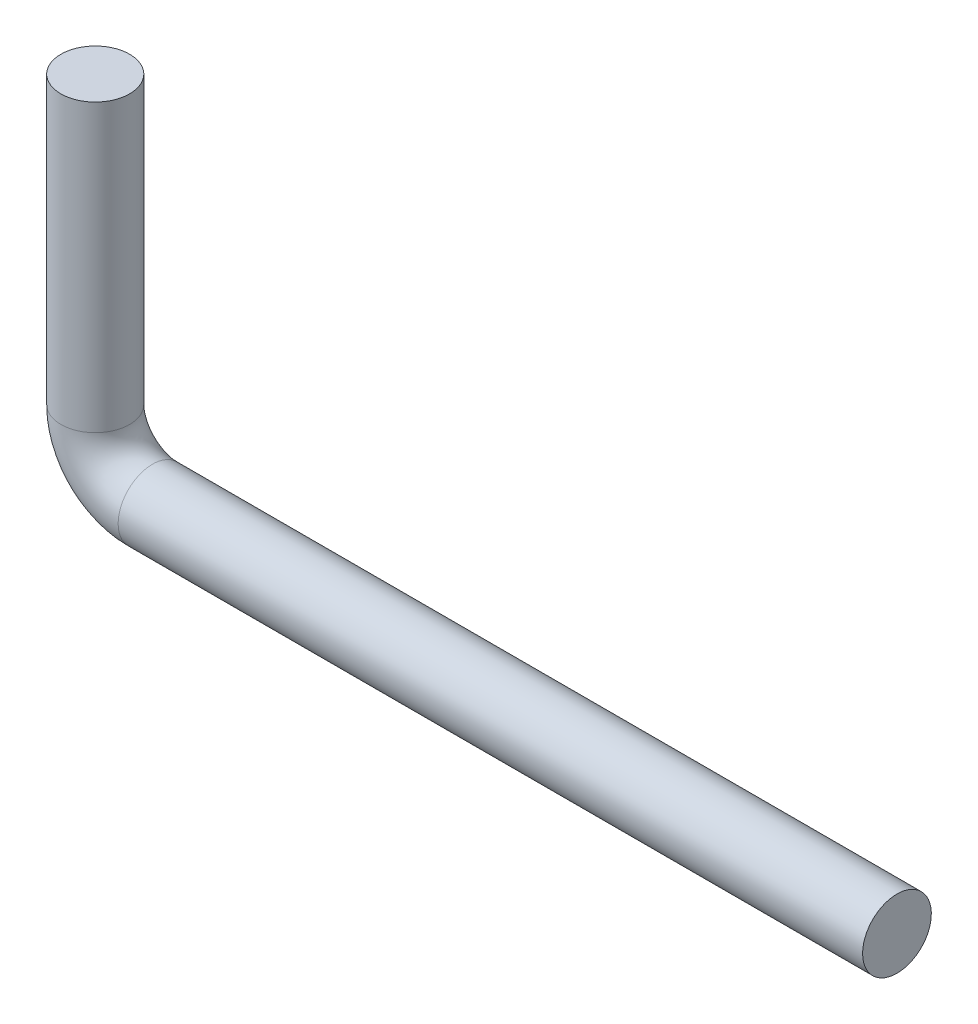
ISO-10303-21;
HEADER;
FILE_DESCRIPTION(('STEP AP214'),'2;1');
FILE_NAME('part.step','',(''),(''),'','','');
FILE_SCHEMA(('AUTOMOTIVE_DESIGN { 1 0 10303 214 1 1 1 1 }'));
ENDSEC;
DATA;
#1=APPLICATION_CONTEXT('core data for automotive mechanical design processes');
#2=APPLICATION_PROTOCOL_DEFINITION('international standard','automotive_design',2000,#1);
#3=PRODUCT_CONTEXT('',#1,'mechanical');
#4=PRODUCT('Part','Part','',(#3));
#5=PRODUCT_RELATED_PRODUCT_CATEGORY('part','',(#4));
#6=PRODUCT_DEFINITION_FORMATION('','',#4);
#7=PRODUCT_DEFINITION_CONTEXT('part definition',#1,'design');
#8=PRODUCT_DEFINITION('design','',#6,#7);
#9=PRODUCT_DEFINITION_SHAPE('','',#8);
#10=(LENGTH_UNIT() NAMED_UNIT(*) SI_UNIT(.MILLI.,.METRE.));
#11=(NAMED_UNIT(*) PLANE_ANGLE_UNIT() SI_UNIT($,.RADIAN.));
#12=(NAMED_UNIT(*) SI_UNIT($,.STERADIAN.) SOLID_ANGLE_UNIT());
#13=UNCERTAINTY_MEASURE_WITH_UNIT(LENGTH_MEASURE(1.E-05),#10,'distance_accuracy_value','');
#14=(GEOMETRIC_REPRESENTATION_CONTEXT(3) GLOBAL_UNCERTAINTY_ASSIGNED_CONTEXT((#13)) GLOBAL_UNIT_ASSIGNED_CONTEXT((#10,
#11,#12)) REPRESENTATION_CONTEXT('',''));
#15=CARTESIAN_POINT('',(0.,0.,0.));
#16=DIRECTION('',(0.,0.,1.));
#17=DIRECTION('',(1.,0.,0.));
#18=AXIS2_PLACEMENT_3D('',#15,#16,#17);
#19=CARTESIAN_POINT('',(0.,60.,0.));
#20=DIRECTION('',(0.,1.,0.));
#21=DIRECTION('',(0.,0.,1.));
#22=AXIS2_PLACEMENT_3D('',#19,#20,#21);
#23=PLANE('',#22);
#24=CARTESIAN_POINT('',(0.,60.,0.));
#25=DIRECTION('',(0.,1.,0.));
#26=DIRECTION('',(0.,0.,1.));
#27=AXIS2_PLACEMENT_3D('',#24,#25,#26);
#28=CIRCLE('',#27,6.);
#29=CARTESIAN_POINT('',(0.,60.,6.));
#30=VERTEX_POINT('',#29);
#31=EDGE_CURVE('E54',#30,#30,#28,.T.);
#32=ORIENTED_EDGE('',*,*,#31,.T.);
#33=EDGE_LOOP('',(#32));
#34=FACE_BOUND('',#33,.T.);
#35=ADVANCED_FACE('F37',(#34),#23,.T.);
#36=CARTESIAN_POINT('',(140.,0.,0.));
#37=DIRECTION('',(-1.,0.,0.));
#38=DIRECTION('',(0.,0.,1.));
#39=AXIS2_PLACEMENT_3D('',#36,#37,#38);
#40=PLANE('',#39);
#41=CARTESIAN_POINT('',(140.,0.,0.));
#42=DIRECTION('',(-1.,0.,0.));
#43=DIRECTION('',(0.,0.,1.));
#44=AXIS2_PLACEMENT_3D('',#41,#42,#43);
#45=CIRCLE('',#44,6.);
#46=CARTESIAN_POINT('',(140.,0.,6.));
#47=VERTEX_POINT('',#46);
#48=EDGE_CURVE('E10',#47,#47,#45,.T.);
#49=ORIENTED_EDGE('',*,*,#48,.F.);
#50=EDGE_LOOP('',(#49));
#51=FACE_BOUND('',#50,.T.);
#52=ADVANCED_FACE('F65',(#51),#40,.F.);
#53=CARTESIAN_POINT('',(0.,60.,0.));
#54=DIRECTION('',(0.,-1.,0.));
#55=DIRECTION('',(0.,0.,-1.));
#56=AXIS2_PLACEMENT_3D('',#53,#54,#55);
#57=CYLINDRICAL_SURFACE('',#56,6.);
#58=CARTESIAN_POINT('',(0.,10.0000000000001,0.));
#59=DIRECTION('',(0.,1.,0.));
#60=DIRECTION('',(0.,0.,1.));
#61=AXIS2_PLACEMENT_3D('',#58,#59,#60);
#62=CIRCLE('',#61,6.);
#63=CARTESIAN_POINT('',(-6.00000000000044,10.0000000000001,0.));
#64=VERTEX_POINT('',#63);
#65=EDGE_CURVE('E49',#64,#64,#62,.T.);
#66=ORIENTED_EDGE('',*,*,#65,.T.);
#67=EDGE_LOOP('',(#66));
#68=FACE_BOUND('',#67,.T.);
#69=ORIENTED_EDGE('',*,*,#31,.F.);
#70=EDGE_LOOP('',(#69));
#71=FACE_BOUND('',#70,.T.);
#72=ADVANCED_FACE('F62',(#68,#71),#57,.T.);
#73=CARTESIAN_POINT('',(10.,10.,0.));
#74=DIRECTION('',(0.,0.,1.));
#75=DIRECTION('',(1.,0.,0.));
#76=AXIS2_PLACEMENT_3D('',#73,#74,#75);
#77=TOROIDAL_SURFACE('',#76,10.0000000000004,6.);
#78=CARTESIAN_POINT('',(10.0000000000001,0.,0.));
#79=DIRECTION('',(-1.,0.,0.));
#80=DIRECTION('',(0.,0.,1.));
#81=AXIS2_PLACEMENT_3D('',#78,#79,#80);
#82=CIRCLE('',#81,6.);
#83=CARTESIAN_POINT('',(10.0000000000001,-6.00000000000044,0.));
#84=VERTEX_POINT('',#83);
#85=EDGE_CURVE('E44',#84,#84,#82,.T.);
#86=CARTESIAN_POINT('',(10.,10.,0.));
#87=DIRECTION('',(0.,0.,1.));
#88=DIRECTION('',(1.,0.,0.));
#89=AXIS2_PLACEMENT_3D('',#86,#87,#88);
#90=CIRCLE('',#89,16.0000000000004);
#91=EDGE_CURVE('',#64,#84,#90,.T.);
#92=ORIENTED_EDGE('',*,*,#65,.F.);
#93=ORIENTED_EDGE('',*,*,#85,.T.);
#94=ORIENTED_EDGE('',*,*,#91,.T.);
#95=ORIENTED_EDGE('',*,*,#91,.F.);
#96=EDGE_LOOP('',(#92,#94,#93,#95));
#97=FACE_BOUND('',#96,.T.);
#98=ADVANCED_FACE('F64',(#97),#77,.T.);
#99=CARTESIAN_POINT('',(10.0000000000001,0.,0.));
#100=DIRECTION('',(1.,0.,0.));
#101=DIRECTION('',(0.,0.,-1.));
#102=AXIS2_PLACEMENT_3D('',#99,#100,#101);
#103=CYLINDRICAL_SURFACE('',#102,6.);
#104=ORIENTED_EDGE('',*,*,#48,.T.);
#105=EDGE_LOOP('',(#104));
#106=FACE_BOUND('',#105,.T.);
#107=ORIENTED_EDGE('',*,*,#85,.F.);
#108=EDGE_LOOP('',(#107));
#109=FACE_BOUND('',#108,.T.);
#110=ADVANCED_FACE('F72',(#106,#109),#103,.T.);
#111=CLOSED_SHELL('',(#35,#52,#72,#98,#110));
#112=MANIFOLD_SOLID_BREP('B2',#111);
#113=ADVANCED_BREP_SHAPE_REPRESENTATION('',(#18,#112),#14);
#114=SHAPE_DEFINITION_REPRESENTATION(#9,#113);
ENDSEC;
END-ISO-10303-21;
